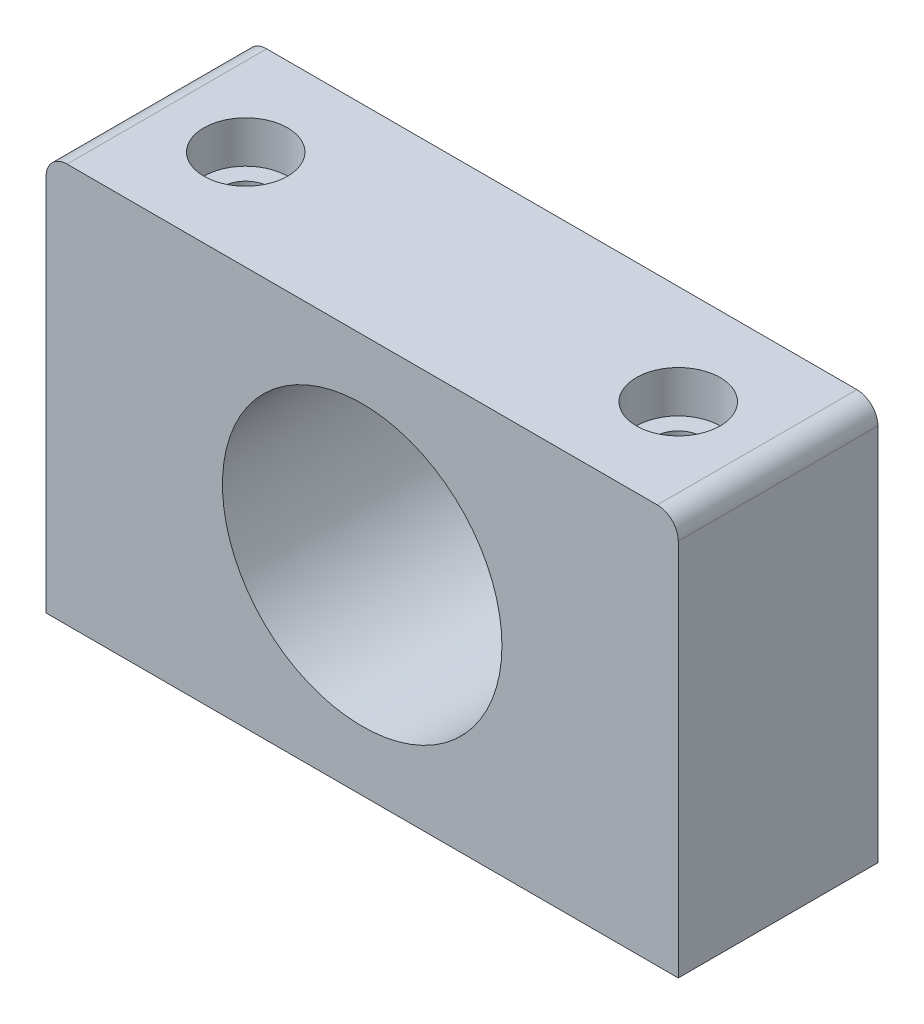
ISO-10303-21;
HEADER;
FILE_DESCRIPTION(('STEP AP214'),'2;1');
FILE_NAME('part.step','',(''),(''),'','','');
FILE_SCHEMA(('AUTOMOTIVE_DESIGN { 1 0 10303 214 1 1 1 1 }'));
ENDSEC;
DATA;
#1=APPLICATION_CONTEXT('core data for automotive mechanical design processes');
#2=APPLICATION_PROTOCOL_DEFINITION('international standard','automotive_design',2000,#1);
#3=PRODUCT_CONTEXT('',#1,'mechanical');
#4=PRODUCT('Part','Part','',(#3));
#5=PRODUCT_RELATED_PRODUCT_CATEGORY('part','',(#4));
#6=PRODUCT_DEFINITION_FORMATION('','',#4);
#7=PRODUCT_DEFINITION_CONTEXT('part definition',#1,'design');
#8=PRODUCT_DEFINITION('design','',#6,#7);
#9=PRODUCT_DEFINITION_SHAPE('','',#8);
#10=(LENGTH_UNIT() NAMED_UNIT(*) SI_UNIT(.MILLI.,.METRE.));
#11=(NAMED_UNIT(*) PLANE_ANGLE_UNIT() SI_UNIT($,.RADIAN.));
#12=(NAMED_UNIT(*) SI_UNIT($,.STERADIAN.) SOLID_ANGLE_UNIT());
#13=UNCERTAINTY_MEASURE_WITH_UNIT(LENGTH_MEASURE(1.E-05),#10,'distance_accuracy_value','');
#14=(GEOMETRIC_REPRESENTATION_CONTEXT(3) GLOBAL_UNCERTAINTY_ASSIGNED_CONTEXT((#13)) GLOBAL_UNIT_ASSIGNED_CONTEXT((#10,
#11,#12)) REPRESENTATION_CONTEXT('',''));
#15=CARTESIAN_POINT('',(0.,0.,0.));
#16=DIRECTION('',(0.,0.,1.));
#17=DIRECTION('',(1.,0.,0.));
#18=AXIS2_PLACEMENT_3D('',#15,#16,#17);
#19=CARTESIAN_POINT('',(0.,38.1,0.));
#20=DIRECTION('',(0.,-1.,0.));
#21=DIRECTION('',(0.,0.,-1.));
#22=AXIS2_PLACEMENT_3D('',#19,#20,#21);
#23=PLANE('',#22);
#24=CARTESIAN_POINT('',(-20.6375,38.1,0.));
#25=DIRECTION('',(0.,1.,0.));
#26=DIRECTION('',(0.,0.,1.));
#27=AXIS2_PLACEMENT_3D('',#24,#25,#26);
#28=CIRCLE('',#27,4.);
#29=CARTESIAN_POINT('',(-20.6375,38.1,4.00000000000001));
#30=VERTEX_POINT('',#29);
#31=EDGE_CURVE('E212',#30,#30,#28,.T.);
#32=ORIENTED_EDGE('',*,*,#31,.F.);
#33=EDGE_LOOP('',(#32));
#34=FACE_BOUND('',#33,.T.);
#35=DIRECTION('',(1.,0.,0.));
#36=VECTOR('',#35,1.);
#37=CARTESIAN_POINT('',(-30.1625,38.1,9.525));
#38=LINE('',#37,#36);
#39=CARTESIAN_POINT('',(-28.1625,38.1,9.525));
#40=VERTEX_POINT('',#39);
#41=CARTESIAN_POINT('',(28.1625,38.1,9.525));
#42=VERTEX_POINT('',#41);
#43=EDGE_CURVE('E114',#40,#42,#38,.T.);
#44=ORIENTED_EDGE('',*,*,#43,.T.);
#45=DIRECTION('',(0.,0.,-1.));
#46=VECTOR('',#45,1.);
#47=CARTESIAN_POINT('',(28.1625,38.1,0.));
#48=LINE('',#47,#46);
#49=CARTESIAN_POINT('',(28.1625,38.1,-9.525));
#50=VERTEX_POINT('',#49);
#51=EDGE_CURVE('E127',#42,#50,#48,.T.);
#52=ORIENTED_EDGE('',*,*,#51,.T.);
#53=DIRECTION('',(-1.,0.,0.));
#54=VECTOR('',#53,1.);
#55=CARTESIAN_POINT('',(-30.1625,38.1,-9.525));
#56=LINE('',#55,#54);
#57=CARTESIAN_POINT('',(-28.1625,38.1,-9.525));
#58=VERTEX_POINT('',#57);
#59=EDGE_CURVE('E120',#50,#58,#56,.T.);
#60=ORIENTED_EDGE('',*,*,#59,.T.);
#61=DIRECTION('',(0.,0.,1.));
#62=VECTOR('',#61,1.);
#63=CARTESIAN_POINT('',(-28.1625,38.1,0.));
#64=LINE('',#63,#62);
#65=EDGE_CURVE('E94',#58,#40,#64,.T.);
#66=ORIENTED_EDGE('',*,*,#65,.T.);
#67=EDGE_LOOP('',(#44,#52,#60,#66));
#68=FACE_BOUND('',#67,.T.);
#69=CARTESIAN_POINT('',(20.6375,38.1,0.));
#70=DIRECTION('',(0.,1.,0.));
#71=DIRECTION('',(0.,0.,1.));
#72=AXIS2_PLACEMENT_3D('',#69,#70,#71);
#73=CIRCLE('',#72,4.);
#74=CARTESIAN_POINT('',(20.6375,38.1,4.));
#75=VERTEX_POINT('',#74);
#76=EDGE_CURVE('E200',#75,#75,#73,.T.);
#77=ORIENTED_EDGE('',*,*,#76,.F.);
#78=EDGE_LOOP('',(#77));
#79=FACE_BOUND('',#78,.T.);
#80=ADVANCED_FACE('F33',(#34,#68,#79),#23,.F.);
#81=CARTESIAN_POINT('',(30.1625,38.1,9.525));
#82=DIRECTION('',(-1.,0.,0.));
#83=DIRECTION('',(0.,0.,1.));
#84=AXIS2_PLACEMENT_3D('',#81,#82,#83);
#85=PLANE('',#84);
#86=DIRECTION('',(0.,-1.,0.));
#87=VECTOR('',#86,1.);
#88=CARTESIAN_POINT('',(30.1625,38.1,-9.525));
#89=LINE('',#88,#87);
#90=CARTESIAN_POINT('',(30.1625,36.1,-9.525));
#91=VERTEX_POINT('',#90);
#92=CARTESIAN_POINT('',(30.1625,0.,-9.525));
#93=VERTEX_POINT('',#92);
#94=EDGE_CURVE('E85',#91,#93,#89,.T.);
#95=ORIENTED_EDGE('',*,*,#94,.F.);
#96=DIRECTION('',(0.,0.,-1.));
#97=VECTOR('',#96,1.);
#98=CARTESIAN_POINT('',(30.1625,36.1,9.525));
#99=LINE('',#98,#97);
#100=CARTESIAN_POINT('',(30.1625,36.1,9.525));
#101=VERTEX_POINT('',#100);
#102=EDGE_CURVE('E56',#91,#101,#99,.F.);
#103=ORIENTED_EDGE('',*,*,#102,.T.);
#104=DIRECTION('',(0.,-1.,0.));
#105=VECTOR('',#104,1.);
#106=CARTESIAN_POINT('',(30.1625,38.1,9.525));
#107=LINE('',#106,#105);
#108=CARTESIAN_POINT('',(30.1625,0.,9.525));
#109=VERTEX_POINT('',#108);
#110=EDGE_CURVE('E106',#101,#109,#107,.T.);
#111=ORIENTED_EDGE('',*,*,#110,.T.);
#112=DIRECTION('',(0.,0.,-1.));
#113=VECTOR('',#112,1.);
#114=CARTESIAN_POINT('',(30.1625,0.,9.525));
#115=LINE('',#114,#113);
#116=EDGE_CURVE('E101',#109,#93,#115,.T.);
#117=ORIENTED_EDGE('',*,*,#116,.T.);
#118=EDGE_LOOP('',(#95,#103,#111,#117));
#119=FACE_BOUND('',#118,.T.);
#120=ADVANCED_FACE('F105',(#119),#85,.F.);
#121=CARTESIAN_POINT('',(-30.1625,38.1,-9.525));
#122=DIRECTION('',(0.,0.,1.));
#123=DIRECTION('',(1.,0.,0.));
#124=AXIS2_PLACEMENT_3D('',#121,#122,#123);
#125=PLANE('',#124);
#126=CARTESIAN_POINT('',(0.,19.05,-9.525));
#127=DIRECTION('',(0.,0.,1.));
#128=DIRECTION('',(1.,0.,0.));
#129=AXIS2_PLACEMENT_3D('',#126,#127,#128);
#130=CIRCLE('',#129,13.335);
#131=CARTESIAN_POINT('',(13.335,19.05,-9.525));
#132=VERTEX_POINT('',#131);
#133=EDGE_CURVE('E108',#132,#132,#130,.T.);
#134=ORIENTED_EDGE('',*,*,#133,.T.);
#135=EDGE_LOOP('',(#134));
#136=FACE_BOUND('',#135,.T.);
#137=ORIENTED_EDGE('',*,*,#59,.F.);
#138=CARTESIAN_POINT('',(28.1625,36.1,-9.525));
#139=DIRECTION('',(0.,0.,1.));
#140=DIRECTION('',(1.,0.,0.));
#141=AXIS2_PLACEMENT_3D('',#138,#139,#140);
#142=CIRCLE('',#141,2.);
#143=EDGE_CURVE('E92',#50,#91,#142,.F.);
#144=ORIENTED_EDGE('',*,*,#143,.T.);
#145=ORIENTED_EDGE('',*,*,#94,.T.);
#146=DIRECTION('',(-1.,0.,0.));
#147=VECTOR('',#146,1.);
#148=CARTESIAN_POINT('',(-30.1625,0.,-9.525));
#149=LINE('',#148,#147);
#150=CARTESIAN_POINT('',(-30.1625,0.,-9.525));
#151=VERTEX_POINT('',#150);
#152=EDGE_CURVE('E90',#93,#151,#149,.T.);
#153=ORIENTED_EDGE('',*,*,#152,.T.);
#154=DIRECTION('',(0.,-1.,0.));
#155=VECTOR('',#154,1.);
#156=CARTESIAN_POINT('',(-30.1625,38.1,-9.525));
#157=LINE('',#156,#155);
#158=CARTESIAN_POINT('',(-30.1625,36.1,-9.525));
#159=VERTEX_POINT('',#158);
#160=EDGE_CURVE('E95',#159,#151,#157,.T.);
#161=ORIENTED_EDGE('',*,*,#160,.F.);
#162=CARTESIAN_POINT('',(-28.1625,36.1,-9.525));
#163=DIRECTION('',(0.,0.,1.));
#164=DIRECTION('',(1.,0.,0.));
#165=AXIS2_PLACEMENT_3D('',#162,#163,#164);
#166=CIRCLE('',#165,2.);
#167=EDGE_CURVE('E130',#159,#58,#166,.F.);
#168=ORIENTED_EDGE('',*,*,#167,.T.);
#169=EDGE_LOOP('',(#137,#144,#145,#153,#161,#168));
#170=FACE_BOUND('',#169,.T.);
#171=ADVANCED_FACE('F88',(#136,#170),#125,.F.);
#172=CARTESIAN_POINT('',(-30.1625,38.1,9.525));
#173=DIRECTION('',(1.,0.,0.));
#174=DIRECTION('',(0.,0.,-1.));
#175=AXIS2_PLACEMENT_3D('',#172,#173,#174);
#176=PLANE('',#175);
#177=DIRECTION('',(0.,-1.,0.));
#178=VECTOR('',#177,1.);
#179=CARTESIAN_POINT('',(-30.1625,38.1,9.525));
#180=LINE('',#179,#178);
#181=CARTESIAN_POINT('',(-30.1625,36.1,9.525));
#182=VERTEX_POINT('',#181);
#183=CARTESIAN_POINT('',(-30.1625,0.,9.525));
#184=VERTEX_POINT('',#183);
#185=EDGE_CURVE('E122',#182,#184,#180,.T.);
#186=ORIENTED_EDGE('',*,*,#185,.F.);
#187=DIRECTION('',(0.,0.,1.));
#188=VECTOR('',#187,1.);
#189=CARTESIAN_POINT('',(-30.1625,36.1,9.525));
#190=LINE('',#189,#188);
#191=EDGE_CURVE('E11',#182,#159,#190,.F.);
#192=ORIENTED_EDGE('',*,*,#191,.T.);
#193=ORIENTED_EDGE('',*,*,#160,.T.);
#194=DIRECTION('',(0.,0.,1.));
#195=VECTOR('',#194,1.);
#196=CARTESIAN_POINT('',(-30.1625,0.,9.525));
#197=LINE('',#196,#195);
#198=EDGE_CURVE('E103',#151,#184,#197,.T.);
#199=ORIENTED_EDGE('',*,*,#198,.T.);
#200=EDGE_LOOP('',(#186,#192,#193,#199));
#201=FACE_BOUND('',#200,.T.);
#202=ADVANCED_FACE('F171',(#201),#176,.F.);
#203=CARTESIAN_POINT('',(-30.1625,38.1,9.525));
#204=DIRECTION('',(0.,0.,-1.));
#205=DIRECTION('',(-1.,0.,0.));
#206=AXIS2_PLACEMENT_3D('',#203,#204,#205);
#207=PLANE('',#206);
#208=CARTESIAN_POINT('',(0.,19.05,9.525));
#209=DIRECTION('',(0.,0.,1.));
#210=DIRECTION('',(1.,0.,0.));
#211=AXIS2_PLACEMENT_3D('',#208,#209,#210);
#212=CIRCLE('',#211,13.335);
#213=CARTESIAN_POINT('',(13.335,19.05,9.525));
#214=VERTEX_POINT('',#213);
#215=EDGE_CURVE('E111',#214,#214,#212,.T.);
#216=ORIENTED_EDGE('',*,*,#215,.F.);
#217=EDGE_LOOP('',(#216));
#218=FACE_BOUND('',#217,.T.);
#219=ORIENTED_EDGE('',*,*,#110,.F.);
#220=CARTESIAN_POINT('',(28.1625,36.1,9.525));
#221=DIRECTION('',(0.,0.,-1.));
#222=DIRECTION('',(-1.,0.,0.));
#223=AXIS2_PLACEMENT_3D('',#220,#221,#222);
#224=CIRCLE('',#223,2.);
#225=EDGE_CURVE('E41',#101,#42,#224,.F.);
#226=ORIENTED_EDGE('',*,*,#225,.T.);
#227=ORIENTED_EDGE('',*,*,#43,.F.);
#228=CARTESIAN_POINT('',(-28.1625,36.1,9.525));
#229=DIRECTION('',(0.,0.,-1.));
#230=DIRECTION('',(-1.,0.,0.));
#231=AXIS2_PLACEMENT_3D('',#228,#229,#230);
#232=CIRCLE('',#231,2.);
#233=EDGE_CURVE('E48',#40,#182,#232,.F.);
#234=ORIENTED_EDGE('',*,*,#233,.T.);
#235=ORIENTED_EDGE('',*,*,#185,.T.);
#236=DIRECTION('',(1.,0.,0.));
#237=VECTOR('',#236,1.);
#238=CARTESIAN_POINT('',(-30.1625,0.,9.525));
#239=LINE('',#238,#237);
#240=EDGE_CURVE('E118',#184,#109,#239,.T.);
#241=ORIENTED_EDGE('',*,*,#240,.T.);
#242=EDGE_LOOP('',(#219,#226,#227,#234,#235,#241));
#243=FACE_BOUND('',#242,.T.);
#244=ADVANCED_FACE('F136',(#218,#243),#207,.F.);
#245=CARTESIAN_POINT('',(0.,0.,0.));
#246=DIRECTION('',(0.,-1.,0.));
#247=DIRECTION('',(0.,0.,-1.));
#248=AXIS2_PLACEMENT_3D('',#245,#246,#247);
#249=PLANE('',#248);
#250=CARTESIAN_POINT('',(-20.6375,0.,0.));
#251=DIRECTION('',(0.,1.,0.));
#252=DIRECTION('',(0.,0.,1.));
#253=AXIS2_PLACEMENT_3D('',#250,#251,#252);
#254=CIRCLE('',#253,2.24999999999999);
#255=CARTESIAN_POINT('',(-20.6375,0.,2.24999999999999));
#256=VERTEX_POINT('',#255);
#257=EDGE_CURVE('E203',#256,#256,#254,.T.);
#258=ORIENTED_EDGE('',*,*,#257,.T.);
#259=EDGE_LOOP('',(#258));
#260=FACE_BOUND('',#259,.T.);
#261=CARTESIAN_POINT('',(20.6375,0.,0.));
#262=DIRECTION('',(0.,1.,0.));
#263=DIRECTION('',(0.,0.,1.));
#264=AXIS2_PLACEMENT_3D('',#261,#262,#263);
#265=CIRCLE('',#264,2.24999999999999);
#266=CARTESIAN_POINT('',(20.6375,0.,2.24999999999999));
#267=VERTEX_POINT('',#266);
#268=EDGE_CURVE('E187',#267,#267,#265,.T.);
#269=ORIENTED_EDGE('',*,*,#268,.T.);
#270=EDGE_LOOP('',(#269));
#271=FACE_BOUND('',#270,.T.);
#272=ORIENTED_EDGE('',*,*,#116,.F.);
#273=ORIENTED_EDGE('',*,*,#240,.F.);
#274=ORIENTED_EDGE('',*,*,#198,.F.);
#275=ORIENTED_EDGE('',*,*,#152,.F.);
#276=EDGE_LOOP('',(#272,#273,#274,#275));
#277=FACE_BOUND('',#276,.T.);
#278=ADVANCED_FACE('F99',(#260,#271,#277),#249,.T.);
#279=CARTESIAN_POINT('',(0.,19.05,-9.525));
#280=DIRECTION('',(0.,0.,1.));
#281=DIRECTION('',(1.,0.,0.));
#282=AXIS2_PLACEMENT_3D('',#279,#280,#281);
#283=CYLINDRICAL_SURFACE('',#282,13.335);
#284=ORIENTED_EDGE('',*,*,#133,.F.);
#285=EDGE_LOOP('',(#284));
#286=FACE_BOUND('',#285,.T.);
#287=ORIENTED_EDGE('',*,*,#215,.T.);
#288=EDGE_LOOP('',(#287));
#289=FACE_BOUND('',#288,.T.);
#290=ADVANCED_FACE('F164',(#286,#289),#283,.F.);
#291=CARTESIAN_POINT('',(20.6375,38.1,0.));
#292=DIRECTION('',(0.,1.,0.));
#293=DIRECTION('',(0.,0.,1.));
#294=AXIS2_PLACEMENT_3D('',#291,#292,#293);
#295=CYLINDRICAL_SURFACE('',#294,2.24999999999999);
#296=ORIENTED_EDGE('',*,*,#268,.F.);
#297=EDGE_LOOP('',(#296));
#298=FACE_BOUND('',#297,.T.);
#299=CARTESIAN_POINT('',(20.6375,34.1,0.));
#300=DIRECTION('',(0.,1.,0.));
#301=DIRECTION('',(0.,0.,1.));
#302=AXIS2_PLACEMENT_3D('',#299,#300,#301);
#303=CIRCLE('',#302,2.25);
#304=CARTESIAN_POINT('',(20.6375,34.1,2.25));
#305=VERTEX_POINT('',#304);
#306=EDGE_CURVE('E190',#305,#305,#303,.T.);
#307=ORIENTED_EDGE('',*,*,#306,.T.);
#308=EDGE_LOOP('',(#307));
#309=FACE_BOUND('',#308,.T.);
#310=ADVANCED_FACE('F184',(#298,#309),#295,.F.);
#311=CARTESIAN_POINT('',(22.8875,34.1,0.));
#312=DIRECTION('',(0.,-1.,0.));
#313=DIRECTION('',(0.,0.,-1.));
#314=AXIS2_PLACEMENT_3D('',#311,#312,#313);
#315=PLANE('',#314);
#316=ORIENTED_EDGE('',*,*,#306,.F.);
#317=EDGE_LOOP('',(#316));
#318=FACE_BOUND('',#317,.T.);
#319=CARTESIAN_POINT('',(20.6375,34.1,0.));
#320=DIRECTION('',(0.,1.,0.));
#321=DIRECTION('',(0.,0.,1.));
#322=AXIS2_PLACEMENT_3D('',#319,#320,#321);
#323=CIRCLE('',#322,4.);
#324=CARTESIAN_POINT('',(20.6375,34.1,4.));
#325=VERTEX_POINT('',#324);
#326=EDGE_CURVE('E197',#325,#325,#323,.T.);
#327=ORIENTED_EDGE('',*,*,#326,.T.);
#328=EDGE_LOOP('',(#327));
#329=FACE_BOUND('',#328,.T.);
#330=ADVANCED_FACE('F231',(#318,#329),#315,.F.);
#331=CARTESIAN_POINT('',(20.6375,38.1,0.));
#332=DIRECTION('',(0.,1.,0.));
#333=DIRECTION('',(0.,0.,1.));
#334=AXIS2_PLACEMENT_3D('',#331,#332,#333);
#335=CYLINDRICAL_SURFACE('',#334,4.);
#336=ORIENTED_EDGE('',*,*,#326,.F.);
#337=EDGE_LOOP('',(#336));
#338=FACE_BOUND('',#337,.T.);
#339=ORIENTED_EDGE('',*,*,#76,.T.);
#340=EDGE_LOOP('',(#339));
#341=FACE_BOUND('',#340,.T.);
#342=ADVANCED_FACE('F224',(#338,#341),#335,.F.);
#343=CARTESIAN_POINT('',(-20.6375,38.1,0.));
#344=DIRECTION('',(0.,1.,0.));
#345=DIRECTION('',(0.,0.,1.));
#346=AXIS2_PLACEMENT_3D('',#343,#344,#345);
#347=CYLINDRICAL_SURFACE('',#346,2.24999999999999);
#348=ORIENTED_EDGE('',*,*,#257,.F.);
#349=EDGE_LOOP('',(#348));
#350=FACE_BOUND('',#349,.T.);
#351=CARTESIAN_POINT('',(-20.6375,34.1,0.));
#352=DIRECTION('',(0.,1.,0.));
#353=DIRECTION('',(0.,0.,1.));
#354=AXIS2_PLACEMENT_3D('',#351,#352,#353);
#355=CIRCLE('',#354,2.25);
#356=CARTESIAN_POINT('',(-20.6375,34.1,2.25));
#357=VERTEX_POINT('',#356);
#358=EDGE_CURVE('E206',#357,#357,#355,.T.);
#359=ORIENTED_EDGE('',*,*,#358,.T.);
#360=EDGE_LOOP('',(#359));
#361=FACE_BOUND('',#360,.T.);
#362=ADVANCED_FACE('F218',(#350,#361),#347,.F.);
#363=CARTESIAN_POINT('',(-18.3875,34.1,0.));
#364=DIRECTION('',(0.,-1.,0.));
#365=DIRECTION('',(0.,0.,-1.));
#366=AXIS2_PLACEMENT_3D('',#363,#364,#365);
#367=PLANE('',#366);
#368=ORIENTED_EDGE('',*,*,#358,.F.);
#369=EDGE_LOOP('',(#368));
#370=FACE_BOUND('',#369,.T.);
#371=CARTESIAN_POINT('',(-20.6375,34.1,0.));
#372=DIRECTION('',(0.,1.,0.));
#373=DIRECTION('',(0.,0.,1.));
#374=AXIS2_PLACEMENT_3D('',#371,#372,#373);
#375=CIRCLE('',#374,4.);
#376=CARTESIAN_POINT('',(-20.6375,34.1,4.00000000000001));
#377=VERTEX_POINT('',#376);
#378=EDGE_CURVE('E209',#377,#377,#375,.T.);
#379=ORIENTED_EDGE('',*,*,#378,.T.);
#380=EDGE_LOOP('',(#379));
#381=FACE_BOUND('',#380,.T.);
#382=ADVANCED_FACE('F151',(#370,#381),#367,.F.);
#383=CARTESIAN_POINT('',(-20.6375,38.1,0.));
#384=DIRECTION('',(0.,1.,0.));
#385=DIRECTION('',(0.,0.,1.));
#386=AXIS2_PLACEMENT_3D('',#383,#384,#385);
#387=CYLINDRICAL_SURFACE('',#386,4.);
#388=ORIENTED_EDGE('',*,*,#378,.F.);
#389=EDGE_LOOP('',(#388));
#390=FACE_BOUND('',#389,.T.);
#391=ORIENTED_EDGE('',*,*,#31,.T.);
#392=EDGE_LOOP('',(#391));
#393=FACE_BOUND('',#392,.T.);
#394=ADVANCED_FACE('F145',(#390,#393),#387,.F.);
#395=CARTESIAN_POINT('',(28.1625,36.1,0.));
#396=DIRECTION('',(0.,0.,-1.));
#397=DIRECTION('',(-1.,0.,0.));
#398=AXIS2_PLACEMENT_3D('',#395,#396,#397);
#399=CYLINDRICAL_SURFACE('',#398,2.);
#400=ORIENTED_EDGE('',*,*,#225,.F.);
#401=ORIENTED_EDGE('',*,*,#102,.F.);
#402=ORIENTED_EDGE('',*,*,#143,.F.);
#403=ORIENTED_EDGE('',*,*,#51,.F.);
#404=EDGE_LOOP('',(#400,#401,#402,#403));
#405=FACE_BOUND('',#404,.T.);
#406=ADVANCED_FACE('F143',(#405),#399,.T.);
#407=CARTESIAN_POINT('',(-28.1625,36.1,0.));
#408=DIRECTION('',(0.,0.,1.));
#409=DIRECTION('',(1.,0.,0.));
#410=AXIS2_PLACEMENT_3D('',#407,#408,#409);
#411=CYLINDRICAL_SURFACE('',#410,2.);
#412=ORIENTED_EDGE('',*,*,#167,.F.);
#413=ORIENTED_EDGE('',*,*,#191,.F.);
#414=ORIENTED_EDGE('',*,*,#233,.F.);
#415=ORIENTED_EDGE('',*,*,#65,.F.);
#416=EDGE_LOOP('',(#412,#413,#414,#415));
#417=FACE_BOUND('',#416,.T.);
#418=ADVANCED_FACE('F35',(#417),#411,.T.);
#419=CLOSED_SHELL('',(#80,#120,#171,#202,#244,#278,#290,#310,#330,#342,#362,#382,#394,#406,#418));
#420=MANIFOLD_SOLID_BREP('B2',#419);
#421=ADVANCED_BREP_SHAPE_REPRESENTATION('',(#18,#420),#14);
#422=SHAPE_DEFINITION_REPRESENTATION(#9,#421);
ENDSEC;
END-ISO-10303-21;
